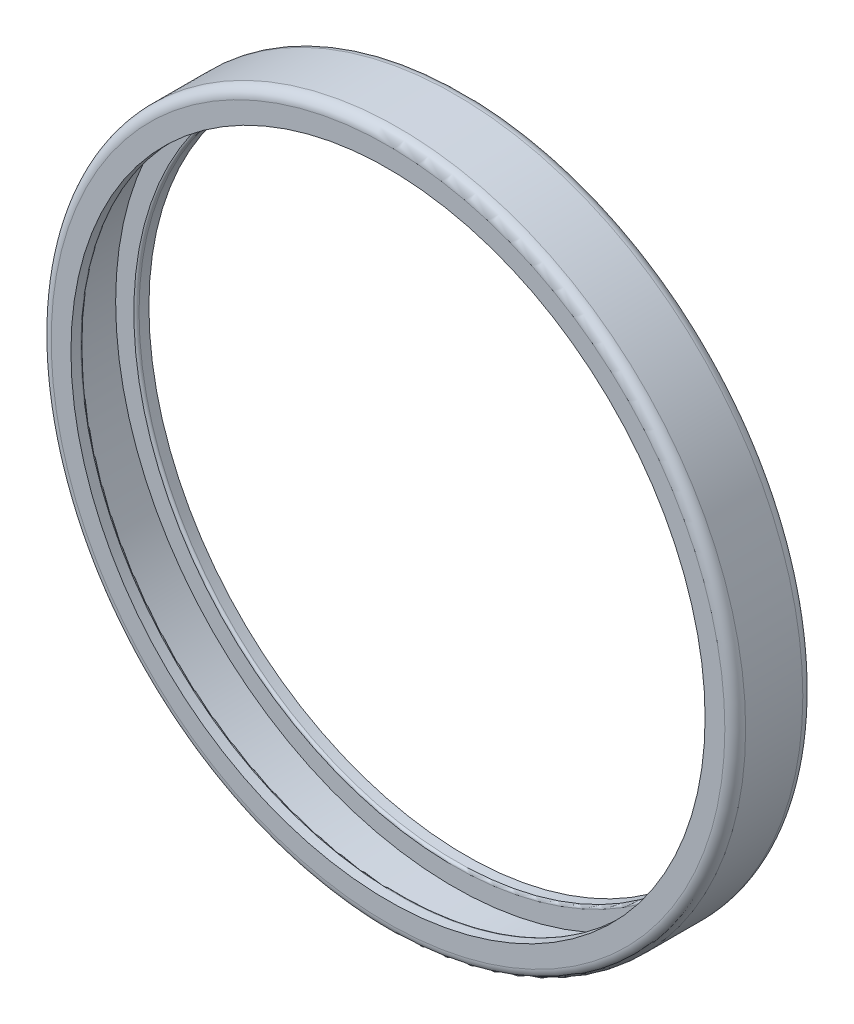
ISO-10303-21;
HEADER;
FILE_DESCRIPTION(('STEP AP214'),'2;1');
FILE_NAME('part.step','',(''),(''),'','','');
FILE_SCHEMA(('AUTOMOTIVE_DESIGN { 1 0 10303 214 1 1 1 1 }'));
ENDSEC;
DATA;
#1=APPLICATION_CONTEXT('core data for automotive mechanical design processes');
#2=APPLICATION_PROTOCOL_DEFINITION('international standard','automotive_design',2000,#1);
#3=PRODUCT_CONTEXT('',#1,'mechanical');
#4=PRODUCT('Part','Part','',(#3));
#5=PRODUCT_RELATED_PRODUCT_CATEGORY('part','',(#4));
#6=PRODUCT_DEFINITION_FORMATION('','',#4);
#7=PRODUCT_DEFINITION_CONTEXT('part definition',#1,'design');
#8=PRODUCT_DEFINITION('design','',#6,#7);
#9=PRODUCT_DEFINITION_SHAPE('','',#8);
#10=(LENGTH_UNIT() NAMED_UNIT(*) SI_UNIT(.MILLI.,.METRE.));
#11=(NAMED_UNIT(*) PLANE_ANGLE_UNIT() SI_UNIT($,.RADIAN.));
#12=(NAMED_UNIT(*) SI_UNIT($,.STERADIAN.) SOLID_ANGLE_UNIT());
#13=UNCERTAINTY_MEASURE_WITH_UNIT(LENGTH_MEASURE(1.E-05),#10,'distance_accuracy_value','');
#14=(GEOMETRIC_REPRESENTATION_CONTEXT(3) GLOBAL_UNCERTAINTY_ASSIGNED_CONTEXT((#13)) GLOBAL_UNIT_ASSIGNED_CONTEXT((#10,
#11,#12)) REPRESENTATION_CONTEXT('',''));
#15=CARTESIAN_POINT('',(0.,0.,0.));
#16=DIRECTION('',(0.,0.,1.));
#17=DIRECTION('',(1.,0.,0.));
#18=AXIS2_PLACEMENT_3D('',#15,#16,#17);
#19=CARTESIAN_POINT('',(0.,33.4,3.75));
#20=DIRECTION('',(0.,0.,1.));
#21=DIRECTION('',(1.,0.,0.));
#22=AXIS2_PLACEMENT_3D('',#19,#20,#21);
#23=PLANE('',#22);
#24=CARTESIAN_POINT('',(0.,0.,3.75));
#25=DIRECTION('',(0.,0.,1.));
#26=DIRECTION('',(1.,0.,0.));
#27=AXIS2_PLACEMENT_3D('',#24,#25,#26);
#28=CIRCLE('',#27,32.4);
#29=CARTESIAN_POINT('',(32.4,0.,3.75));
#30=VERTEX_POINT('',#29);
#31=EDGE_CURVE('E10',#30,#30,#28,.T.);
#32=ORIENTED_EDGE('',*,*,#31,.T.);
#33=EDGE_LOOP('',(#32));
#34=FACE_BOUND('',#33,.T.);
#35=CARTESIAN_POINT('',(0.,0.,3.75));
#36=DIRECTION('',(0.,0.,-1.));
#37=DIRECTION('',(-1.,0.,0.));
#38=AXIS2_PLACEMENT_3D('',#35,#36,#37);
#39=CIRCLE('',#38,30.5);
#40=CARTESIAN_POINT('',(-30.5,0.,3.75));
#41=VERTEX_POINT('',#40);
#42=EDGE_CURVE('E62',#41,#41,#39,.T.);
#43=ORIENTED_EDGE('',*,*,#42,.T.);
#44=EDGE_LOOP('',(#43));
#45=FACE_BOUND('',#44,.T.);
#46=ADVANCED_FACE('F30',(#34,#45),#23,.T.);
#47=CARTESIAN_POINT('',(0.,0.,-25.));
#48=DIRECTION('',(0.,0.,-1.));
#49=DIRECTION('',(-1.,0.,0.));
#50=AXIS2_PLACEMENT_3D('',#47,#48,#49);
#51=CYLINDRICAL_SURFACE('',#50,30.5);
#52=CARTESIAN_POINT('',(0.,0.,2.8));
#53=DIRECTION('',(0.,0.,-1.));
#54=DIRECTION('',(-1.,0.,0.));
#55=AXIS2_PLACEMENT_3D('',#52,#53,#54);
#56=CIRCLE('',#55,30.5);
#57=CARTESIAN_POINT('',(-30.5,0.,2.8));
#58=VERTEX_POINT('',#57);
#59=EDGE_CURVE('E59',#58,#58,#56,.T.);
#60=ORIENTED_EDGE('',*,*,#59,.T.);
#61=EDGE_LOOP('',(#60));
#62=FACE_BOUND('',#61,.T.);
#63=ORIENTED_EDGE('',*,*,#42,.F.);
#64=EDGE_LOOP('',(#63));
#65=FACE_BOUND('',#64,.T.);
#66=ADVANCED_FACE('F92',(#62,#65),#51,.F.);
#67=CARTESIAN_POINT('',(0.,30.5,2.55));
#68=DIRECTION('',(0.,0.,-1.));
#69=DIRECTION('',(-1.,0.,0.));
#70=AXIS2_PLACEMENT_3D('',#67,#68,#69);
#71=PLANE('',#70);
#72=CARTESIAN_POINT('',(0.,0.,2.55));
#73=DIRECTION('',(0.,0.,-1.));
#74=DIRECTION('',(-1.,0.,0.));
#75=AXIS2_PLACEMENT_3D('',#72,#73,#74);
#76=CIRCLE('',#75,30.75);
#77=CARTESIAN_POINT('',(-30.75,0.,2.55));
#78=VERTEX_POINT('',#77);
#79=EDGE_CURVE('E56',#78,#78,#76,.F.);
#80=ORIENTED_EDGE('',*,*,#79,.T.);
#81=EDGE_LOOP('',(#80));
#82=FACE_BOUND('',#81,.T.);
#83=CARTESIAN_POINT('',(0.,0.,2.55));
#84=DIRECTION('',(0.,0.,-1.));
#85=DIRECTION('',(-1.,0.,0.));
#86=AXIS2_PLACEMENT_3D('',#83,#84,#85);
#87=CIRCLE('',#86,32.5);
#88=CARTESIAN_POINT('',(-32.5,0.,2.55));
#89=VERTEX_POINT('',#88);
#90=EDGE_CURVE('E65',#89,#89,#87,.T.);
#91=ORIENTED_EDGE('',*,*,#90,.T.);
#92=EDGE_LOOP('',(#91));
#93=FACE_BOUND('',#92,.T.);
#94=ADVANCED_FACE('F97',(#82,#93),#71,.T.);
#95=CARTESIAN_POINT('',(0.,0.,-25.));
#96=DIRECTION('',(0.,0.,-1.));
#97=DIRECTION('',(-1.,0.,0.));
#98=AXIS2_PLACEMENT_3D('',#95,#96,#97);
#99=CYLINDRICAL_SURFACE('',#98,32.5);
#100=CARTESIAN_POINT('',(0.,0.,-2.55));
#101=DIRECTION('',(0.,0.,-1.));
#102=DIRECTION('',(-1.,0.,0.));
#103=AXIS2_PLACEMENT_3D('',#100,#101,#102);
#104=CIRCLE('',#103,32.5);
#105=CARTESIAN_POINT('',(-32.5,0.,-2.55));
#106=VERTEX_POINT('',#105);
#107=EDGE_CURVE('E68',#106,#106,#104,.T.);
#108=ORIENTED_EDGE('',*,*,#107,.T.);
#109=EDGE_LOOP('',(#108));
#110=FACE_BOUND('',#109,.T.);
#111=ORIENTED_EDGE('',*,*,#90,.F.);
#112=EDGE_LOOP('',(#111));
#113=FACE_BOUND('',#112,.T.);
#114=ADVANCED_FACE('F169',(#110,#113),#99,.F.);
#115=CARTESIAN_POINT('',(0.,32.5,-2.55));
#116=DIRECTION('',(0.,0.,1.));
#117=DIRECTION('',(1.,0.,0.));
#118=AXIS2_PLACEMENT_3D('',#115,#116,#117);
#119=PLANE('',#118);
#120=CARTESIAN_POINT('',(0.,0.,-2.55));
#121=DIRECTION('',(0.,0.,1.));
#122=DIRECTION('',(1.,0.,0.));
#123=AXIS2_PLACEMENT_3D('',#120,#121,#122);
#124=CIRCLE('',#123,30.75);
#125=CARTESIAN_POINT('',(30.75,0.,-2.55));
#126=VERTEX_POINT('',#125);
#127=EDGE_CURVE('E53',#126,#126,#124,.F.);
#128=ORIENTED_EDGE('',*,*,#127,.T.);
#129=EDGE_LOOP('',(#128));
#130=FACE_BOUND('',#129,.T.);
#131=ORIENTED_EDGE('',*,*,#107,.F.);
#132=EDGE_LOOP('',(#131));
#133=FACE_BOUND('',#132,.T.);
#134=ADVANCED_FACE('F88',(#130,#133),#119,.T.);
#135=CARTESIAN_POINT('',(0.,0.,-25.));
#136=DIRECTION('',(0.,0.,-1.));
#137=DIRECTION('',(-1.,0.,0.));
#138=AXIS2_PLACEMENT_3D('',#135,#136,#137);
#139=CYLINDRICAL_SURFACE('',#138,30.5);
#140=CARTESIAN_POINT('',(0.,0.,-2.8));
#141=DIRECTION('',(0.,0.,1.));
#142=DIRECTION('',(1.,0.,0.));
#143=AXIS2_PLACEMENT_3D('',#140,#141,#142);
#144=CIRCLE('',#143,30.5);
#145=CARTESIAN_POINT('',(30.5,0.,-2.8));
#146=VERTEX_POINT('',#145);
#147=EDGE_CURVE('E50',#146,#146,#144,.T.);
#148=ORIENTED_EDGE('',*,*,#147,.T.);
#149=EDGE_LOOP('',(#148));
#150=FACE_BOUND('',#149,.T.);
#151=CARTESIAN_POINT('',(0.,0.,-3.75));
#152=DIRECTION('',(0.,0.,-1.));
#153=DIRECTION('',(-1.,0.,0.));
#154=AXIS2_PLACEMENT_3D('',#151,#152,#153);
#155=CIRCLE('',#154,30.5);
#156=CARTESIAN_POINT('',(-30.5,0.,-3.75));
#157=VERTEX_POINT('',#156);
#158=EDGE_CURVE('E71',#157,#157,#155,.T.);
#159=ORIENTED_EDGE('',*,*,#158,.T.);
#160=EDGE_LOOP('',(#159));
#161=FACE_BOUND('',#160,.T.);
#162=ADVANCED_FACE('F75',(#150,#161),#139,.F.);
#163=CARTESIAN_POINT('',(0.,33.4,-3.75));
#164=DIRECTION('',(0.,0.,-1.));
#165=DIRECTION('',(-1.,0.,0.));
#166=AXIS2_PLACEMENT_3D('',#163,#164,#165);
#167=PLANE('',#166);
#168=CARTESIAN_POINT('',(0.,0.,-3.75));
#169=DIRECTION('',(0.,0.,-1.));
#170=DIRECTION('',(-1.,0.,0.));
#171=AXIS2_PLACEMENT_3D('',#168,#169,#170);
#172=CIRCLE('',#171,32.4);
#173=CARTESIAN_POINT('',(-32.4,0.,-3.75));
#174=VERTEX_POINT('',#173);
#175=EDGE_CURVE('E45',#174,#174,#172,.T.);
#176=ORIENTED_EDGE('',*,*,#175,.T.);
#177=EDGE_LOOP('',(#176));
#178=FACE_BOUND('',#177,.T.);
#179=ORIENTED_EDGE('',*,*,#158,.F.);
#180=EDGE_LOOP('',(#179));
#181=FACE_BOUND('',#180,.T.);
#182=ADVANCED_FACE('F77',(#178,#181),#167,.T.);
#183=CARTESIAN_POINT('',(0.,0.,-25.));
#184=DIRECTION('',(0.,0.,-1.));
#185=DIRECTION('',(-1.,0.,0.));
#186=AXIS2_PLACEMENT_3D('',#183,#184,#185);
#187=CYLINDRICAL_SURFACE('',#186,33.4);
#188=CARTESIAN_POINT('',(0.,0.,-2.75));
#189=DIRECTION('',(0.,0.,-1.));
#190=DIRECTION('',(-1.,0.,0.));
#191=AXIS2_PLACEMENT_3D('',#188,#189,#190);
#192=CIRCLE('',#191,33.4);
#193=CARTESIAN_POINT('',(-33.4,0.,-2.75));
#194=VERTEX_POINT('',#193);
#195=EDGE_CURVE('E37',#194,#194,#192,.F.);
#196=ORIENTED_EDGE('',*,*,#195,.T.);
#197=EDGE_LOOP('',(#196));
#198=FACE_BOUND('',#197,.T.);
#199=CARTESIAN_POINT('',(0.,0.,2.75));
#200=DIRECTION('',(0.,0.,1.));
#201=DIRECTION('',(1.,0.,0.));
#202=AXIS2_PLACEMENT_3D('',#199,#200,#201);
#203=CIRCLE('',#202,33.4);
#204=CARTESIAN_POINT('',(33.4,0.,2.75));
#205=VERTEX_POINT('',#204);
#206=EDGE_CURVE('E41',#205,#205,#203,.F.);
#207=ORIENTED_EDGE('',*,*,#206,.T.);
#208=EDGE_LOOP('',(#207));
#209=FACE_BOUND('',#208,.T.);
#210=ADVANCED_FACE('F79',(#198,#209),#187,.T.);
#211=CARTESIAN_POINT('',(0.,0.,2.8));
#212=DIRECTION('',(0.,0.,-1.));
#213=DIRECTION('',(-1.,0.,0.));
#214=AXIS2_PLACEMENT_3D('',#211,#212,#213);
#215=TOROIDAL_SURFACE('',#214,30.75,0.25);
#216=ORIENTED_EDGE('',*,*,#79,.F.);
#217=EDGE_LOOP('',(#216));
#218=FACE_BOUND('',#217,.T.);
#219=ORIENTED_EDGE('',*,*,#59,.F.);
#220=EDGE_LOOP('',(#219));
#221=FACE_BOUND('',#220,.T.);
#222=ADVANCED_FACE('F86',(#218,#221),#215,.T.);
#223=CARTESIAN_POINT('',(0.,0.,-2.8));
#224=DIRECTION('',(0.,0.,1.));
#225=DIRECTION('',(1.,0.,0.));
#226=AXIS2_PLACEMENT_3D('',#223,#224,#225);
#227=TOROIDAL_SURFACE('',#226,30.75,0.25);
#228=ORIENTED_EDGE('',*,*,#147,.F.);
#229=EDGE_LOOP('',(#228));
#230=FACE_BOUND('',#229,.T.);
#231=ORIENTED_EDGE('',*,*,#127,.F.);
#232=EDGE_LOOP('',(#231));
#233=FACE_BOUND('',#232,.T.);
#234=ADVANCED_FACE('F105',(#230,#233),#227,.T.);
#235=CARTESIAN_POINT('',(0.,0.,-2.75));
#236=DIRECTION('',(0.,0.,-1.));
#237=DIRECTION('',(-1.,0.,0.));
#238=AXIS2_PLACEMENT_3D('',#235,#236,#237);
#239=TOROIDAL_SURFACE('',#238,32.4,1.);
#240=ORIENTED_EDGE('',*,*,#195,.F.);
#241=EDGE_LOOP('',(#240));
#242=FACE_BOUND('',#241,.T.);
#243=ORIENTED_EDGE('',*,*,#175,.F.);
#244=EDGE_LOOP('',(#243));
#245=FACE_BOUND('',#244,.T.);
#246=ADVANCED_FACE('F108',(#242,#245),#239,.T.);
#247=CARTESIAN_POINT('',(0.,0.,2.75));
#248=DIRECTION('',(0.,0.,1.));
#249=DIRECTION('',(1.,0.,0.));
#250=AXIS2_PLACEMENT_3D('',#247,#248,#249);
#251=TOROIDAL_SURFACE('',#250,32.4,1.);
#252=ORIENTED_EDGE('',*,*,#31,.F.);
#253=EDGE_LOOP('',(#252));
#254=FACE_BOUND('',#253,.T.);
#255=ORIENTED_EDGE('',*,*,#206,.F.);
#256=EDGE_LOOP('',(#255));
#257=FACE_BOUND('',#256,.T.);
#258=ADVANCED_FACE('F32',(#254,#257),#251,.T.);
#259=CLOSED_SHELL('',(#46,#66,#94,#114,#134,#162,#182,#210,#222,#234,#246,#258));
#260=MANIFOLD_SOLID_BREP('B2',#259);
#261=ADVANCED_BREP_SHAPE_REPRESENTATION('',(#18,#260),#14);
#262=SHAPE_DEFINITION_REPRESENTATION(#9,#261);
ENDSEC;
END-ISO-10303-21;
